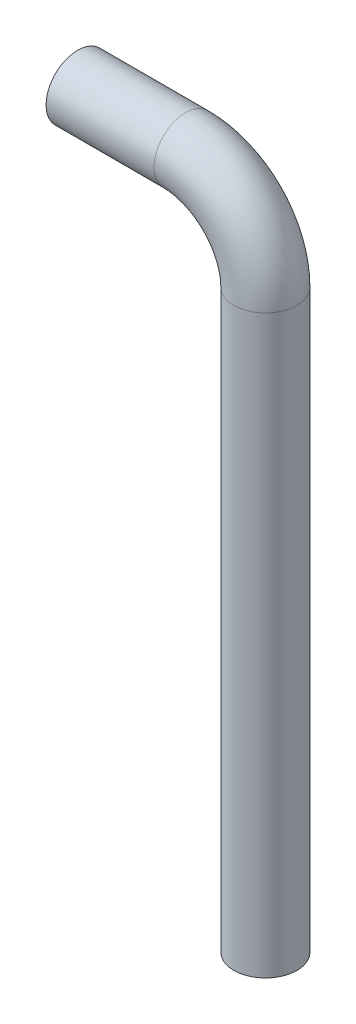
ISO-10303-21;
HEADER;
FILE_DESCRIPTION(('STEP AP214'),'2;1');
FILE_NAME('part.step','',(''),(''),'','','');
FILE_SCHEMA(('AUTOMOTIVE_DESIGN { 1 0 10303 214 1 1 1 1 }'));
ENDSEC;
DATA;
#1=APPLICATION_CONTEXT('core data for automotive mechanical design processes');
#2=APPLICATION_PROTOCOL_DEFINITION('international standard','automotive_design',2000,#1);
#3=PRODUCT_CONTEXT('',#1,'mechanical');
#4=PRODUCT('Part','Part','',(#3));
#5=PRODUCT_RELATED_PRODUCT_CATEGORY('part','',(#4));
#6=PRODUCT_DEFINITION_FORMATION('','',#4);
#7=PRODUCT_DEFINITION_CONTEXT('part definition',#1,'design');
#8=PRODUCT_DEFINITION('design','',#6,#7);
#9=PRODUCT_DEFINITION_SHAPE('','',#8);
#10=(LENGTH_UNIT() NAMED_UNIT(*) SI_UNIT(.MILLI.,.METRE.));
#11=(NAMED_UNIT(*) PLANE_ANGLE_UNIT() SI_UNIT($,.RADIAN.));
#12=(NAMED_UNIT(*) SI_UNIT($,.STERADIAN.) SOLID_ANGLE_UNIT());
#13=UNCERTAINTY_MEASURE_WITH_UNIT(LENGTH_MEASURE(1.E-05),#10,'distance_accuracy_value','');
#14=(GEOMETRIC_REPRESENTATION_CONTEXT(3) GLOBAL_UNCERTAINTY_ASSIGNED_CONTEXT((#13)) GLOBAL_UNIT_ASSIGNED_CONTEXT((#10,
#11,#12)) REPRESENTATION_CONTEXT('',''));
#15=CARTESIAN_POINT('',(0.,0.,0.));
#16=DIRECTION('',(0.,0.,1.));
#17=DIRECTION('',(1.,0.,0.));
#18=AXIS2_PLACEMENT_3D('',#15,#16,#17);
#19=CARTESIAN_POINT('',(0.,0.,0.));
#20=DIRECTION('',(0.,0.,1.));
#21=DIRECTION('',(1.,0.,0.));
#22=AXIS2_PLACEMENT_3D('',#19,#20,#21);
#23=TOROIDAL_SURFACE('',#22,56.3240382166579,22.225);
#24=CARTESIAN_POINT('',(56.3240382166579,0.,0.));
#25=DIRECTION('',(0.,-1.,0.));
#26=DIRECTION('',(0.,0.,-1.));
#27=AXIS2_PLACEMENT_3D('',#24,#25,#26);
#28=CIRCLE('',#27,22.225);
#29=CARTESIAN_POINT('',(78.5490382166578,0.,0.));
#30=VERTEX_POINT('',#29);
#31=EDGE_CURVE('E52',#30,#30,#28,.T.);
#32=CARTESIAN_POINT('',(0.,56.3240382166579,0.));
#33=DIRECTION('',(-1.,0.,0.));
#34=DIRECTION('',(0.,0.,1.));
#35=AXIS2_PLACEMENT_3D('',#32,#33,#34);
#36=CIRCLE('',#35,22.225);
#37=CARTESIAN_POINT('',(0.,78.5490382166578,0.));
#38=VERTEX_POINT('',#37);
#39=EDGE_CURVE('E37',#38,#38,#36,.T.);
#40=CARTESIAN_POINT('',(0.,0.,0.));
#41=DIRECTION('',(0.,0.,1.));
#42=DIRECTION('',(1.,0.,0.));
#43=AXIS2_PLACEMENT_3D('',#40,#41,#42);
#44=CIRCLE('',#43,78.5490382166578);
#45=EDGE_CURVE('',#30,#38,#44,.T.);
#46=ORIENTED_EDGE('',*,*,#31,.F.);
#47=ORIENTED_EDGE('',*,*,#39,.F.);
#48=ORIENTED_EDGE('',*,*,#45,.T.);
#49=ORIENTED_EDGE('',*,*,#45,.F.);
#50=EDGE_LOOP('',(#46,#48,#47,#49));
#51=FACE_BOUND('',#50,.T.);
#52=ADVANCED_FACE('F34',(#51),#23,.T.);
#53=CARTESIAN_POINT('',(0.,0.,0.));
#54=DIRECTION('',(0.,0.,1.));
#55=DIRECTION('',(1.,0.,0.));
#56=AXIS2_PLACEMENT_3D('',#53,#54,#55);
#57=TOROIDAL_SURFACE('',#56,56.3240382166579,19.05);
#58=CARTESIAN_POINT('',(56.3240382166579,0.,0.));
#59=DIRECTION('',(0.,-1.,0.));
#60=DIRECTION('',(0.,0.,-1.));
#61=AXIS2_PLACEMENT_3D('',#58,#59,#60);
#62=CIRCLE('',#61,19.05);
#63=CARTESIAN_POINT('',(75.3740382166579,0.,0.));
#64=VERTEX_POINT('',#63);
#65=EDGE_CURVE('E58',#64,#64,#62,.T.);
#66=CARTESIAN_POINT('',(0.,56.3240382166579,0.));
#67=DIRECTION('',(-1.,0.,0.));
#68=DIRECTION('',(0.,0.,1.));
#69=AXIS2_PLACEMENT_3D('',#66,#67,#68);
#70=CIRCLE('',#69,19.05);
#71=CARTESIAN_POINT('',(0.,75.3740382166579,0.));
#72=VERTEX_POINT('',#71);
#73=EDGE_CURVE('E10',#72,#72,#70,.F.);
#74=CARTESIAN_POINT('',(0.,0.,0.));
#75=DIRECTION('',(0.,0.,1.));
#76=DIRECTION('',(1.,0.,0.));
#77=AXIS2_PLACEMENT_3D('',#74,#75,#76);
#78=CIRCLE('',#77,75.3740382166579);
#79=EDGE_CURVE('',#64,#72,#78,.T.);
#80=ORIENTED_EDGE('',*,*,#65,.T.);
#81=ORIENTED_EDGE('',*,*,#73,.F.);
#82=ORIENTED_EDGE('',*,*,#79,.T.);
#83=ORIENTED_EDGE('',*,*,#79,.F.);
#84=EDGE_LOOP('',(#80,#82,#81,#83));
#85=FACE_BOUND('',#84,.T.);
#86=ADVANCED_FACE('F83',(#85),#57,.F.);
#87=CARTESIAN_POINT('',(-76.2,56.3240382166579,0.));
#88=DIRECTION('',(-1.,0.,0.));
#89=DIRECTION('',(0.,-1.,0.));
#90=AXIS2_PLACEMENT_3D('',#87,#88,#89);
#91=PLANE('',#90);
#92=CARTESIAN_POINT('',(-76.2,56.3240382166579,0.));
#93=DIRECTION('',(-1.,0.,0.));
#94=DIRECTION('',(0.,-1.,0.));
#95=AXIS2_PLACEMENT_3D('',#92,#93,#94);
#96=CIRCLE('',#95,22.225);
#97=CARTESIAN_POINT('',(-76.2,34.0990382166579,0.));
#98=VERTEX_POINT('',#97);
#99=EDGE_CURVE('E44',#98,#98,#96,.T.);
#100=ORIENTED_EDGE('',*,*,#99,.T.);
#101=EDGE_LOOP('',(#100));
#102=FACE_BOUND('',#101,.T.);
#103=CARTESIAN_POINT('',(-76.2,56.3240382166579,0.));
#104=DIRECTION('',(-1.,0.,0.));
#105=DIRECTION('',(0.,-1.,0.));
#106=AXIS2_PLACEMENT_3D('',#103,#104,#105);
#107=CIRCLE('',#106,19.05);
#108=CARTESIAN_POINT('',(-76.2,37.2740382166579,0.));
#109=VERTEX_POINT('',#108);
#110=EDGE_CURVE('E48',#109,#109,#107,.T.);
#111=ORIENTED_EDGE('',*,*,#110,.F.);
#112=EDGE_LOOP('',(#111));
#113=FACE_BOUND('',#112,.T.);
#114=ADVANCED_FACE('F85',(#102,#113),#91,.T.);
#115=CARTESIAN_POINT('',(-76.2,56.3240382166579,0.));
#116=DIRECTION('',(1.,0.,0.));
#117=DIRECTION('',(0.,1.,0.));
#118=AXIS2_PLACEMENT_3D('',#115,#116,#117);
#119=CYLINDRICAL_SURFACE('',#118,22.225);
#120=ORIENTED_EDGE('',*,*,#99,.F.);
#121=EDGE_LOOP('',(#120));
#122=FACE_BOUND('',#121,.T.);
#123=ORIENTED_EDGE('',*,*,#39,.T.);
#124=EDGE_LOOP('',(#123));
#125=FACE_BOUND('',#124,.T.);
#126=ADVANCED_FACE('F79',(#122,#125),#119,.T.);
#127=CARTESIAN_POINT('',(-76.2,56.3240382166579,0.));
#128=DIRECTION('',(1.,0.,0.));
#129=DIRECTION('',(0.,1.,0.));
#130=AXIS2_PLACEMENT_3D('',#127,#128,#129);
#131=CYLINDRICAL_SURFACE('',#130,19.05);
#132=ORIENTED_EDGE('',*,*,#110,.T.);
#133=EDGE_LOOP('',(#132));
#134=FACE_BOUND('',#133,.T.);
#135=ORIENTED_EDGE('',*,*,#73,.T.);
#136=EDGE_LOOP('',(#135));
#137=FACE_BOUND('',#136,.T.);
#138=ADVANCED_FACE('F70',(#134,#137),#131,.F.);
#139=CARTESIAN_POINT('',(56.3240382166579,-406.4,0.));
#140=DIRECTION('',(0.,-1.,0.));
#141=DIRECTION('',(0.,0.,-1.));
#142=AXIS2_PLACEMENT_3D('',#139,#140,#141);
#143=PLANE('',#142);
#144=CARTESIAN_POINT('',(56.3240382166579,-406.4,0.));
#145=DIRECTION('',(0.,-1.,0.));
#146=DIRECTION('',(0.,0.,-1.));
#147=AXIS2_PLACEMENT_3D('',#144,#145,#146);
#148=CIRCLE('',#147,22.225);
#149=CARTESIAN_POINT('',(56.3240382166579,-406.4,-22.225));
#150=VERTEX_POINT('',#149);
#151=EDGE_CURVE('E51',#150,#150,#148,.T.);
#152=ORIENTED_EDGE('',*,*,#151,.T.);
#153=EDGE_LOOP('',(#152));
#154=FACE_BOUND('',#153,.T.);
#155=CARTESIAN_POINT('',(56.3240382166579,-406.4,0.));
#156=DIRECTION('',(0.,-1.,0.));
#157=DIRECTION('',(0.,0.,-1.));
#158=AXIS2_PLACEMENT_3D('',#155,#156,#157);
#159=CIRCLE('',#158,19.05);
#160=CARTESIAN_POINT('',(56.3240382166579,-406.4,-19.05));
#161=VERTEX_POINT('',#160);
#162=EDGE_CURVE('E55',#161,#161,#159,.T.);
#163=ORIENTED_EDGE('',*,*,#162,.F.);
#164=EDGE_LOOP('',(#163));
#165=FACE_BOUND('',#164,.T.);
#166=ADVANCED_FACE('F67',(#154,#165),#143,.T.);
#167=CARTESIAN_POINT('',(56.3240382166579,-406.4,0.));
#168=DIRECTION('',(0.,1.,0.));
#169=DIRECTION('',(0.,0.,1.));
#170=AXIS2_PLACEMENT_3D('',#167,#168,#169);
#171=CYLINDRICAL_SURFACE('',#170,22.225);
#172=ORIENTED_EDGE('',*,*,#151,.F.);
#173=EDGE_LOOP('',(#172));
#174=FACE_BOUND('',#173,.T.);
#175=ORIENTED_EDGE('',*,*,#31,.T.);
#176=EDGE_LOOP('',(#175));
#177=FACE_BOUND('',#176,.T.);
#178=ADVANCED_FACE('F69',(#174,#177),#171,.T.);
#179=CARTESIAN_POINT('',(56.3240382166579,-406.4,0.));
#180=DIRECTION('',(0.,1.,0.));
#181=DIRECTION('',(0.,0.,1.));
#182=AXIS2_PLACEMENT_3D('',#179,#180,#181);
#183=CYLINDRICAL_SURFACE('',#182,19.05);
#184=ORIENTED_EDGE('',*,*,#162,.T.);
#185=EDGE_LOOP('',(#184));
#186=FACE_BOUND('',#185,.T.);
#187=ORIENTED_EDGE('',*,*,#65,.F.);
#188=EDGE_LOOP('',(#187));
#189=FACE_BOUND('',#188,.T.);
#190=ADVANCED_FACE('F64',(#186,#189),#183,.F.);
#191=CLOSED_SHELL('',(#52,#86,#114,#126,#138,#166,#178,#190));
#192=MANIFOLD_SOLID_BREP('B2',#191);
#193=ADVANCED_BREP_SHAPE_REPRESENTATION('',(#18,#192),#14);
#194=SHAPE_DEFINITION_REPRESENTATION(#9,#193);
ENDSEC;
END-ISO-10303-21;
